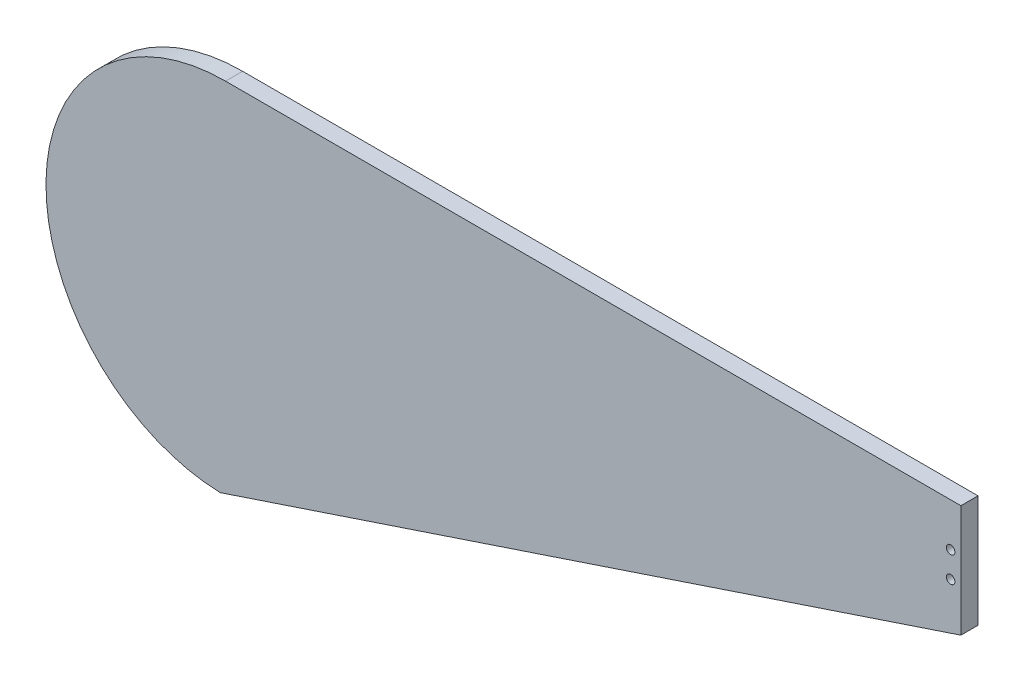
ISO-10303-21;
HEADER;
FILE_DESCRIPTION(('STEP AP214'),'2;1');
FILE_NAME('part.step','',(''),(''),'','','');
FILE_SCHEMA(('AUTOMOTIVE_DESIGN { 1 0 10303 214 1 1 1 1 }'));
ENDSEC;
DATA;
#1=APPLICATION_CONTEXT('core data for automotive mechanical design processes');
#2=APPLICATION_PROTOCOL_DEFINITION('international standard','automotive_design',2000,#1);
#3=PRODUCT_CONTEXT('',#1,'mechanical');
#4=PRODUCT('Part','Part','',(#3));
#5=PRODUCT_RELATED_PRODUCT_CATEGORY('part','',(#4));
#6=PRODUCT_DEFINITION_FORMATION('','',#4);
#7=PRODUCT_DEFINITION_CONTEXT('part definition',#1,'design');
#8=PRODUCT_DEFINITION('design','',#6,#7);
#9=PRODUCT_DEFINITION_SHAPE('','',#8);
#10=(LENGTH_UNIT() NAMED_UNIT(*) SI_UNIT(.MILLI.,.METRE.));
#11=(NAMED_UNIT(*) PLANE_ANGLE_UNIT() SI_UNIT($,.RADIAN.));
#12=(NAMED_UNIT(*) SI_UNIT($,.STERADIAN.) SOLID_ANGLE_UNIT());
#13=UNCERTAINTY_MEASURE_WITH_UNIT(LENGTH_MEASURE(1.E-05),#10,'distance_accuracy_value','');
#14=(GEOMETRIC_REPRESENTATION_CONTEXT(3) GLOBAL_UNCERTAINTY_ASSIGNED_CONTEXT((#13)) GLOBAL_UNIT_ASSIGNED_CONTEXT((#10,
#11,#12)) REPRESENTATION_CONTEXT('',''));
#15=CARTESIAN_POINT('',(0.,0.,0.));
#16=DIRECTION('',(0.,0.,1.));
#17=DIRECTION('',(1.,0.,0.));
#18=AXIS2_PLACEMENT_3D('',#15,#16,#17);
#19=CARTESIAN_POINT('',(0.,0.,10.));
#20=DIRECTION('',(0.,0.,-1.));
#21=DIRECTION('',(-1.,0.,0.));
#22=AXIS2_PLACEMENT_3D('',#19,#20,#21);
#23=CYLINDRICAL_SURFACE('',#22,105.);
#24=CARTESIAN_POINT('',(0.,0.,0.));
#25=DIRECTION('',(0.,0.,1.));
#26=DIRECTION('',(1.,0.,0.));
#27=AXIS2_PLACEMENT_3D('',#24,#25,#26);
#28=CIRCLE('',#27,105.);
#29=CARTESIAN_POINT('',(0.,105.,0.));
#30=VERTEX_POINT('',#29);
#31=CARTESIAN_POINT('',(-3.10756629118514,-104.954004362606,0.));
#32=VERTEX_POINT('',#31);
#33=EDGE_CURVE('E99',#30,#32,#28,.T.);
#34=ORIENTED_EDGE('',*,*,#33,.T.);
#35=DIRECTION('',(0.,0.,-1.));
#36=VECTOR('',#35,1.);
#37=CARTESIAN_POINT('',(-3.10756629118514,-104.954004362606,10.));
#38=LINE('',#37,#36);
#39=CARTESIAN_POINT('',(-3.10756629118514,-104.954004362606,10.));
#40=VERTEX_POINT('',#39);
#41=EDGE_CURVE('E11',#40,#32,#38,.T.);
#42=ORIENTED_EDGE('',*,*,#41,.F.);
#43=CARTESIAN_POINT('',(0.,0.,10.));
#44=DIRECTION('',(0.,0.,1.));
#45=DIRECTION('',(1.,0.,0.));
#46=AXIS2_PLACEMENT_3D('',#43,#44,#45);
#47=CIRCLE('',#46,105.);
#48=CARTESIAN_POINT('',(0.,105.,10.));
#49=VERTEX_POINT('',#48);
#50=EDGE_CURVE('E87',#49,#40,#47,.T.);
#51=ORIENTED_EDGE('',*,*,#50,.F.);
#52=DIRECTION('',(0.,0.,-1.));
#53=VECTOR('',#52,1.);
#54=CARTESIAN_POINT('',(0.,105.,10.));
#55=LINE('',#54,#53);
#56=EDGE_CURVE('E95',#49,#30,#55,.T.);
#57=ORIENTED_EDGE('',*,*,#56,.T.);
#58=EDGE_LOOP('',(#34,#42,#51,#57));
#59=FACE_BOUND('',#58,.T.);
#60=ADVANCED_FACE('F36',(#59),#23,.T.);
#61=CARTESIAN_POINT('',(-3.10756629118514,-104.954004362606,10.));
#62=DIRECTION('',(-0.316227766016838,0.948683298050514,0.));
#63=DIRECTION('',(-0.948683298050514,-0.316227766016838,0.));
#64=AXIS2_PLACEMENT_3D('',#61,#62,#63);
#65=PLANE('',#64);
#66=DIRECTION('',(0.948683298050514,0.316227766016838,0.));
#67=VECTOR('',#66,1.);
#68=CARTESIAN_POINT('',(-3.10756629118514,-104.954004362606,0.));
#69=LINE('',#68,#67);
#70=CARTESIAN_POINT('',(430.,39.4151844011225,0.));
#71=VERTEX_POINT('',#70);
#72=EDGE_CURVE('E91',#32,#71,#69,.T.);
#73=ORIENTED_EDGE('',*,*,#72,.T.);
#74=DIRECTION('',(0.,0.,-1.));
#75=VECTOR('',#74,1.);
#76=CARTESIAN_POINT('',(430.,39.4151844011225,10.));
#77=LINE('',#76,#75);
#78=CARTESIAN_POINT('',(430.,39.4151844011225,10.));
#79=VERTEX_POINT('',#78);
#80=EDGE_CURVE('E44',#79,#71,#77,.T.);
#81=ORIENTED_EDGE('',*,*,#80,.F.);
#82=DIRECTION('',(0.948683298050514,0.316227766016838,0.));
#83=VECTOR('',#82,1.);
#84=CARTESIAN_POINT('',(-3.10756629118514,-104.954004362606,10.));
#85=LINE('',#84,#83);
#86=EDGE_CURVE('E82',#40,#79,#85,.T.);
#87=ORIENTED_EDGE('',*,*,#86,.F.);
#88=ORIENTED_EDGE('',*,*,#41,.T.);
#89=EDGE_LOOP('',(#73,#81,#87,#88));
#90=FACE_BOUND('',#89,.T.);
#91=ADVANCED_FACE('F90',(#90),#65,.F.);
#92=CARTESIAN_POINT('',(430.,39.4151844011225,10.));
#93=DIRECTION('',(-1.,0.,0.));
#94=DIRECTION('',(0.,0.,1.));
#95=AXIS2_PLACEMENT_3D('',#92,#93,#94);
#96=PLANE('',#95);
#97=DIRECTION('',(0.,1.,0.));
#98=VECTOR('',#97,1.);
#99=CARTESIAN_POINT('',(430.,39.4151844011225,0.));
#100=LINE('',#99,#98);
#101=CARTESIAN_POINT('',(430.,105.,0.));
#102=VERTEX_POINT('',#101);
#103=EDGE_CURVE('E69',#71,#102,#100,.T.);
#104=ORIENTED_EDGE('',*,*,#103,.T.);
#105=DIRECTION('',(0.,0.,-1.));
#106=VECTOR('',#105,1.);
#107=CARTESIAN_POINT('',(430.,105.,10.));
#108=LINE('',#107,#106);
#109=CARTESIAN_POINT('',(430.,105.,10.));
#110=VERTEX_POINT('',#109);
#111=EDGE_CURVE('E92',#110,#102,#108,.T.);
#112=ORIENTED_EDGE('',*,*,#111,.F.);
#113=DIRECTION('',(0.,1.,0.));
#114=VECTOR('',#113,1.);
#115=CARTESIAN_POINT('',(430.,39.4151844011225,10.));
#116=LINE('',#115,#114);
#117=EDGE_CURVE('E85',#79,#110,#116,.T.);
#118=ORIENTED_EDGE('',*,*,#117,.F.);
#119=ORIENTED_EDGE('',*,*,#80,.T.);
#120=EDGE_LOOP('',(#104,#112,#118,#119));
#121=FACE_BOUND('',#120,.T.);
#122=ADVANCED_FACE('F93',(#121),#96,.F.);
#123=CARTESIAN_POINT('',(0.,105.,10.));
#124=DIRECTION('',(0.,-1.,0.));
#125=DIRECTION('',(0.,0.,-1.));
#126=AXIS2_PLACEMENT_3D('',#123,#124,#125);
#127=PLANE('',#126);
#128=DIRECTION('',(-1.,0.,0.));
#129=VECTOR('',#128,1.);
#130=CARTESIAN_POINT('',(0.,105.,0.));
#131=LINE('',#130,#129);
#132=EDGE_CURVE('E75',#102,#30,#131,.T.);
#133=ORIENTED_EDGE('',*,*,#132,.T.);
#134=ORIENTED_EDGE('',*,*,#56,.F.);
#135=DIRECTION('',(-1.,0.,0.));
#136=VECTOR('',#135,1.);
#137=CARTESIAN_POINT('',(0.,105.,10.));
#138=LINE('',#137,#136);
#139=EDGE_CURVE('E52',#110,#49,#138,.T.);
#140=ORIENTED_EDGE('',*,*,#139,.F.);
#141=ORIENTED_EDGE('',*,*,#111,.T.);
#142=EDGE_LOOP('',(#133,#134,#140,#141));
#143=FACE_BOUND('',#142,.T.);
#144=ADVANCED_FACE('F107',(#143),#127,.F.);
#145=CARTESIAN_POINT('',(0.,0.,10.));
#146=DIRECTION('',(0.,0.,1.));
#147=DIRECTION('',(1.,0.,0.));
#148=AXIS2_PLACEMENT_3D('',#145,#146,#147);
#149=PLANE('',#148);
#150=CARTESIAN_POINT('',(424.,79.7075922005612,10.));
#151=DIRECTION('',(0.,0.,1.));
#152=DIRECTION('',(1.,0.,0.));
#153=AXIS2_PLACEMENT_3D('',#150,#151,#152);
#154=CIRCLE('',#153,2.50000000000002);
#155=CARTESIAN_POINT('',(426.5,79.7075922005612,10.));
#156=VERTEX_POINT('',#155);
#157=EDGE_CURVE('E119',#156,#156,#154,.T.);
#158=ORIENTED_EDGE('',*,*,#157,.F.);
#159=EDGE_LOOP('',(#158));
#160=FACE_BOUND('',#159,.T.);
#161=CARTESIAN_POINT('',(424.,64.7075922005612,10.));
#162=DIRECTION('',(0.,0.,1.));
#163=DIRECTION('',(1.,0.,0.));
#164=AXIS2_PLACEMENT_3D('',#161,#162,#163);
#165=CIRCLE('',#164,2.50000000000002);
#166=CARTESIAN_POINT('',(426.5,64.7075922005612,10.));
#167=VERTEX_POINT('',#166);
#168=EDGE_CURVE('E116',#167,#167,#165,.T.);
#169=ORIENTED_EDGE('',*,*,#168,.F.);
#170=EDGE_LOOP('',(#169));
#171=FACE_BOUND('',#170,.T.);
#172=ORIENTED_EDGE('',*,*,#50,.T.);
#173=ORIENTED_EDGE('',*,*,#86,.T.);
#174=ORIENTED_EDGE('',*,*,#117,.T.);
#175=ORIENTED_EDGE('',*,*,#139,.T.);
#176=EDGE_LOOP('',(#172,#173,#174,#175));
#177=FACE_BOUND('',#176,.T.);
#178=ADVANCED_FACE('F83',(#160,#171,#177),#149,.T.);
#179=CARTESIAN_POINT('',(0.,0.,0.));
#180=DIRECTION('',(0.,0.,1.));
#181=DIRECTION('',(1.,0.,0.));
#182=AXIS2_PLACEMENT_3D('',#179,#180,#181);
#183=PLANE('',#182);
#184=CARTESIAN_POINT('',(424.,79.7075922005612,0.));
#185=DIRECTION('',(0.,0.,1.));
#186=DIRECTION('',(1.,0.,0.));
#187=AXIS2_PLACEMENT_3D('',#184,#185,#186);
#188=CIRCLE('',#187,2.50000000000002);
#189=CARTESIAN_POINT('',(426.5,79.7075922005612,0.));
#190=VERTEX_POINT('',#189);
#191=EDGE_CURVE('E102',#190,#190,#188,.T.);
#192=ORIENTED_EDGE('',*,*,#191,.T.);
#193=EDGE_LOOP('',(#192));
#194=FACE_BOUND('',#193,.T.);
#195=CARTESIAN_POINT('',(424.,64.7075922005612,0.));
#196=DIRECTION('',(0.,0.,1.));
#197=DIRECTION('',(1.,0.,0.));
#198=AXIS2_PLACEMENT_3D('',#195,#196,#197);
#199=CIRCLE('',#198,2.50000000000002);
#200=CARTESIAN_POINT('',(426.5,64.7075922005612,0.));
#201=VERTEX_POINT('',#200);
#202=EDGE_CURVE('E113',#201,#201,#199,.T.);
#203=ORIENTED_EDGE('',*,*,#202,.T.);
#204=EDGE_LOOP('',(#203));
#205=FACE_BOUND('',#204,.T.);
#206=ORIENTED_EDGE('',*,*,#33,.F.);
#207=ORIENTED_EDGE('',*,*,#132,.F.);
#208=ORIENTED_EDGE('',*,*,#103,.F.);
#209=ORIENTED_EDGE('',*,*,#72,.F.);
#210=EDGE_LOOP('',(#206,#207,#208,#209));
#211=FACE_BOUND('',#210,.T.);
#212=ADVANCED_FACE('F110',(#194,#205,#211),#183,.F.);
#213=CARTESIAN_POINT('',(424.,64.7075922005612,0.));
#214=DIRECTION('',(0.,0.,1.));
#215=DIRECTION('',(1.,0.,0.));
#216=AXIS2_PLACEMENT_3D('',#213,#214,#215);
#217=CYLINDRICAL_SURFACE('',#216,2.50000000000002);
#218=ORIENTED_EDGE('',*,*,#202,.F.);
#219=EDGE_LOOP('',(#218));
#220=FACE_BOUND('',#219,.T.);
#221=ORIENTED_EDGE('',*,*,#168,.T.);
#222=EDGE_LOOP('',(#221));
#223=FACE_BOUND('',#222,.T.);
#224=ADVANCED_FACE('F130',(#220,#223),#217,.F.);
#225=CARTESIAN_POINT('',(424.,79.7075922005612,0.));
#226=DIRECTION('',(0.,0.,1.));
#227=DIRECTION('',(1.,0.,0.));
#228=AXIS2_PLACEMENT_3D('',#225,#226,#227);
#229=CYLINDRICAL_SURFACE('',#228,2.50000000000002);
#230=ORIENTED_EDGE('',*,*,#191,.F.);
#231=EDGE_LOOP('',(#230));
#232=FACE_BOUND('',#231,.T.);
#233=ORIENTED_EDGE('',*,*,#157,.T.);
#234=EDGE_LOOP('',(#233));
#235=FACE_BOUND('',#234,.T.);
#236=ADVANCED_FACE('F127',(#232,#235),#229,.F.);
#237=CLOSED_SHELL('',(#60,#91,#122,#144,#178,#212,#224,#236));
#238=MANIFOLD_SOLID_BREP('B2',#237);
#239=ADVANCED_BREP_SHAPE_REPRESENTATION('',(#18,#238),#14);
#240=SHAPE_DEFINITION_REPRESENTATION(#9,#239);
ENDSEC;
END-ISO-10303-21;
